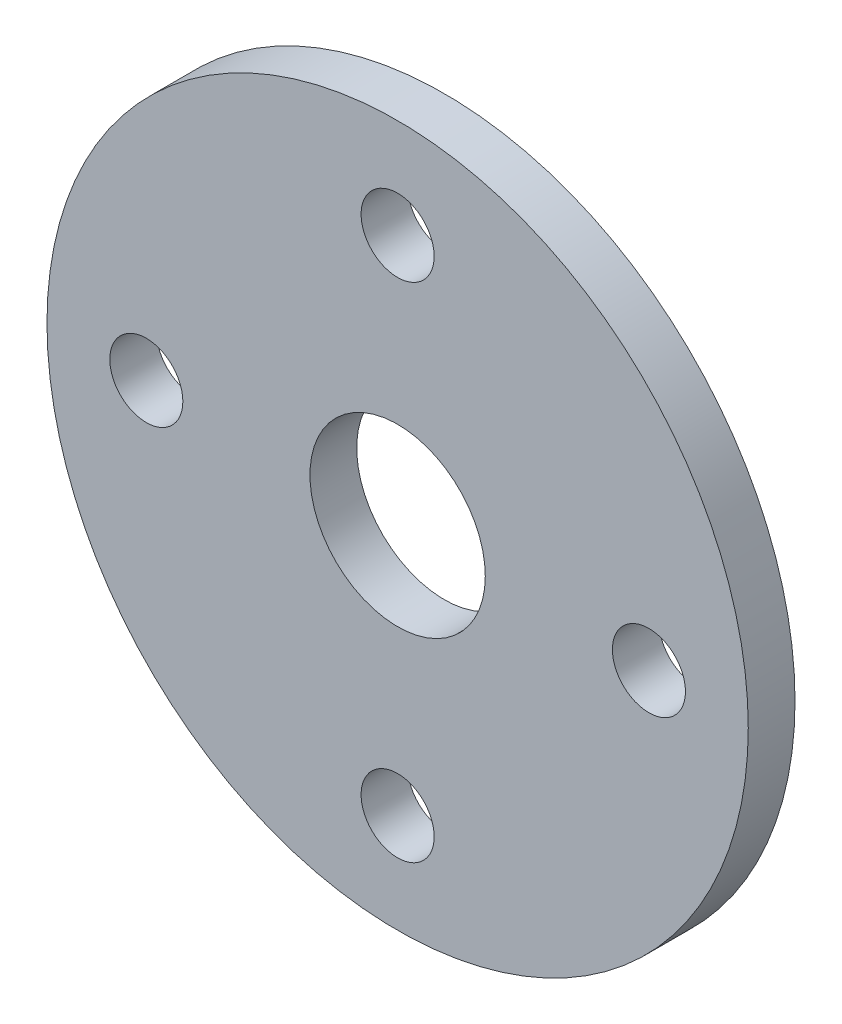
ISO-10303-21;
HEADER;
FILE_DESCRIPTION(('STEP AP214'),'2;1');
FILE_NAME('part.step','',(''),(''),'','','');
FILE_SCHEMA(('AUTOMOTIVE_DESIGN { 1 0 10303 214 1 1 1 1 }'));
ENDSEC;
DATA;
#1=APPLICATION_CONTEXT('core data for automotive mechanical design processes');
#2=APPLICATION_PROTOCOL_DEFINITION('international standard','automotive_design',2000,#1);
#3=PRODUCT_CONTEXT('',#1,'mechanical');
#4=PRODUCT('Part','Part','',(#3));
#5=PRODUCT_RELATED_PRODUCT_CATEGORY('part','',(#4));
#6=PRODUCT_DEFINITION_FORMATION('','',#4);
#7=PRODUCT_DEFINITION_CONTEXT('part definition',#1,'design');
#8=PRODUCT_DEFINITION('design','',#6,#7);
#9=PRODUCT_DEFINITION_SHAPE('','',#8);
#10=(LENGTH_UNIT() NAMED_UNIT(*) SI_UNIT(.MILLI.,.METRE.));
#11=(NAMED_UNIT(*) PLANE_ANGLE_UNIT() SI_UNIT($,.RADIAN.));
#12=(NAMED_UNIT(*) SI_UNIT($,.STERADIAN.) SOLID_ANGLE_UNIT());
#13=UNCERTAINTY_MEASURE_WITH_UNIT(LENGTH_MEASURE(1.E-05),#10,'distance_accuracy_value','');
#14=(GEOMETRIC_REPRESENTATION_CONTEXT(3) GLOBAL_UNCERTAINTY_ASSIGNED_CONTEXT((#13)) GLOBAL_UNIT_ASSIGNED_CONTEXT((#10,
#11,#12)) REPRESENTATION_CONTEXT('',''));
#15=CARTESIAN_POINT('',(0.,0.,0.));
#16=DIRECTION('',(0.,0.,1.));
#17=DIRECTION('',(1.,0.,0.));
#18=AXIS2_PLACEMENT_3D('',#15,#16,#17);
#19=CARTESIAN_POINT('',(2.22044604925031E-13,3.44169137633799E-12,3.99999999999712));
#20=DIRECTION('',(0.,0.,1.));
#21=DIRECTION('',(0.999999999999993,0.,0.));
#22=AXIS2_PLACEMENT_3D('',#19,#20,#21);
#23=PLANE('',#22);
#24=CARTESIAN_POINT('',(1.11022302462516E-13,-42.9999999999983,3.99999999999889));
#25=DIRECTION('',(0.,0.,1.));
#26=DIRECTION('',(0.999999999999993,0.,0.));
#27=AXIS2_PLACEMENT_3D('',#24,#25,#26);
#28=CIRCLE('',#27,6.25);
#29=CARTESIAN_POINT('',(6.25000000000007,-42.9999999999983,3.9999999999989));
#30=VERTEX_POINT('',#29);
#31=EDGE_CURVE('E196',#30,#30,#28,.T.);
#32=ORIENTED_EDGE('',*,*,#31,.F.);
#33=EDGE_LOOP('',(#32));
#34=FACE_BOUND('',#33,.T.);
#35=CARTESIAN_POINT('',(0.,43.0000000000001,4.00000000000023));
#36=DIRECTION('',(0.,0.,1.));
#37=DIRECTION('',(0.999999999999993,0.,0.));
#38=AXIS2_PLACEMENT_3D('',#35,#36,#37);
#39=CIRCLE('',#38,6.25);
#40=CARTESIAN_POINT('',(6.24999999999996,43.0000000000001,4.00000000000023));
#41=VERTEX_POINT('',#40);
#42=EDGE_CURVE('E214',#41,#41,#39,.T.);
#43=ORIENTED_EDGE('',*,*,#42,.F.);
#44=EDGE_LOOP('',(#43));
#45=FACE_BOUND('',#44,.T.);
#46=CARTESIAN_POINT('',(2.22044604925031E-13,3.44169137633799E-12,3.99999999999712));
#47=DIRECTION('',(0.,0.,1.));
#48=DIRECTION('',(0.999999999999993,0.,0.));
#49=AXIS2_PLACEMENT_3D('',#46,#47,#48);
#50=CIRCLE('',#49,60.);
#51=CARTESIAN_POINT('',(59.9999999999998,3.42337269643167E-12,3.99999999999718));
#52=VERTEX_POINT('',#51);
#53=EDGE_CURVE('E12',#52,#52,#50,.T.);
#54=ORIENTED_EDGE('',*,*,#53,.T.);
#55=EDGE_LOOP('',(#54));
#56=FACE_BOUND('',#55,.T.);
#57=CARTESIAN_POINT('',(2.22044604925031E-13,3.44169137633799E-12,3.99999999999712));
#58=DIRECTION('',(0.,0.,1.));
#59=DIRECTION('',(0.999999999999993,0.,0.));
#60=AXIS2_PLACEMENT_3D('',#57,#58,#59);
#61=CIRCLE('',#60,15.);
#62=CARTESIAN_POINT('',(15.0000000000001,3.43711170636141E-12,3.99999999999713));
#63=VERTEX_POINT('',#62);
#64=EDGE_CURVE('E64',#63,#63,#61,.T.);
#65=ORIENTED_EDGE('',*,*,#64,.F.);
#66=EDGE_LOOP('',(#65));
#67=FACE_BOUND('',#66,.T.);
#68=CARTESIAN_POINT('',(-42.9999999999998,2.55351295663786E-12,3.99999999999801));
#69=DIRECTION('',(0.,0.,1.));
#70=DIRECTION('',(0.999999999999993,0.,0.));
#71=AXIS2_PLACEMENT_3D('',#68,#69,#70);
#72=CIRCLE('',#71,6.25);
#73=CARTESIAN_POINT('',(-36.7499999999999,2.55160476081429E-12,3.99999999999801));
#74=VERTEX_POINT('',#73);
#75=EDGE_CURVE('E212',#74,#74,#72,.T.);
#76=ORIENTED_EDGE('',*,*,#75,.F.);
#77=EDGE_LOOP('',(#76));
#78=FACE_BOUND('',#77,.T.);
#79=CARTESIAN_POINT('',(42.9999999999996,1.55431223447522E-12,3.99999999999845));
#80=DIRECTION('',(0.,0.,1.));
#81=DIRECTION('',(0.999999999999993,0.,0.));
#82=AXIS2_PLACEMENT_3D('',#79,#80,#81);
#83=CIRCLE('',#82,6.25);
#84=CARTESIAN_POINT('',(49.2499999999996,1.55240403865164E-12,3.99999999999846));
#85=VERTEX_POINT('',#84);
#86=EDGE_CURVE('E95',#85,#85,#83,.T.);
#87=ORIENTED_EDGE('',*,*,#86,.F.);
#88=EDGE_LOOP('',(#87));
#89=FACE_BOUND('',#88,.T.);
#90=ADVANCED_FACE('F46',(#34,#45,#56,#67,#78,#89),#23,.T.);
#91=CARTESIAN_POINT('',(0.,1.88737914186277E-12,-4.00000000000245));
#92=DIRECTION('',(0.,0.,1.));
#93=DIRECTION('',(0.999999999999993,0.,0.));
#94=AXIS2_PLACEMENT_3D('',#91,#92,#93);
#95=PLANE('',#94);
#96=CARTESIAN_POINT('',(0.,1.88737914186277E-12,-4.00000000000245));
#97=DIRECTION('',(0.,0.,1.));
#98=DIRECTION('',(0.999999999999993,0.,0.));
#99=AXIS2_PLACEMENT_3D('',#96,#97,#98);
#100=CIRCLE('',#99,60.);
#101=CARTESIAN_POINT('',(59.9999999999996,1.86906046195645E-12,-4.00000000000239));
#102=VERTEX_POINT('',#101);
#103=EDGE_CURVE('E51',#102,#102,#100,.T.);
#104=ORIENTED_EDGE('',*,*,#103,.F.);
#105=EDGE_LOOP('',(#104));
#106=FACE_BOUND('',#105,.T.);
#107=CARTESIAN_POINT('',(0.,1.88737914186277E-12,-4.00000000000245));
#108=DIRECTION('',(0.,0.,1.));
#109=DIRECTION('',(0.999999999999993,0.,0.));
#110=AXIS2_PLACEMENT_3D('',#107,#108,#109);
#111=CIRCLE('',#110,15.);
#112=CARTESIAN_POINT('',(14.9999999999999,1.88279947188619E-12,-4.00000000000243));
#113=VERTEX_POINT('',#112);
#114=EDGE_CURVE('E67',#113,#113,#111,.T.);
#115=ORIENTED_EDGE('',*,*,#114,.T.);
#116=EDGE_LOOP('',(#115));
#117=FACE_BOUND('',#116,.T.);
#118=CARTESIAN_POINT('',(1.11022302462516E-13,43.0000000000016,-4.00000000000111));
#119=DIRECTION('',(0.,0.,1.));
#120=DIRECTION('',(0.999999999999993,0.,0.));
#121=AXIS2_PLACEMENT_3D('',#118,#119,#120);
#122=CIRCLE('',#121,6.25);
#123=CARTESIAN_POINT('',(6.25000000000007,43.0000000000016,-4.00000000000111));
#124=VERTEX_POINT('',#123);
#125=EDGE_CURVE('E85',#124,#124,#122,.T.);
#126=ORIENTED_EDGE('',*,*,#125,.T.);
#127=EDGE_LOOP('',(#126));
#128=FACE_BOUND('',#127,.T.);
#129=CARTESIAN_POINT('',(-42.9999999999996,3.21964677141295E-12,-4.00000000000333));
#130=DIRECTION('',(0.,0.,1.));
#131=DIRECTION('',(0.999999999999993,0.,0.));
#132=AXIS2_PLACEMENT_3D('',#129,#130,#131);
#133=CIRCLE('',#132,6.25);
#134=CARTESIAN_POINT('',(-36.7499999999996,3.21773857558938E-12,-4.00000000000333));
#135=VERTEX_POINT('',#134);
#136=EDGE_CURVE('E201',#135,#135,#133,.T.);
#137=ORIENTED_EDGE('',*,*,#136,.T.);
#138=EDGE_LOOP('',(#137));
#139=FACE_BOUND('',#138,.T.);
#140=CARTESIAN_POINT('',(1.11022302462516E-13,-42.9999999999985,-4.00000000000156));
#141=DIRECTION('',(0.,0.,1.));
#142=DIRECTION('',(0.999999999999993,0.,0.));
#143=AXIS2_PLACEMENT_3D('',#140,#141,#142);
#144=CIRCLE('',#143,6.25);
#145=CARTESIAN_POINT('',(6.25000000000007,-42.9999999999985,-4.00000000000155));
#146=VERTEX_POINT('',#145);
#147=EDGE_CURVE('E99',#146,#146,#144,.T.);
#148=ORIENTED_EDGE('',*,*,#147,.T.);
#149=EDGE_LOOP('',(#148));
#150=FACE_BOUND('',#149,.T.);
#151=CARTESIAN_POINT('',(42.9999999999994,1.88737914186277E-12,-4.00000000000067));
#152=DIRECTION('',(0.,0.,1.));
#153=DIRECTION('',(0.999999999999993,0.,0.));
#154=AXIS2_PLACEMENT_3D('',#151,#152,#153);
#155=CIRCLE('',#154,6.25);
#156=CARTESIAN_POINT('',(49.2499999999994,1.88547094603919E-12,-4.00000000000066));
#157=VERTEX_POINT('',#156);
#158=EDGE_CURVE('E100',#157,#157,#155,.T.);
#159=ORIENTED_EDGE('',*,*,#158,.T.);
#160=EDGE_LOOP('',(#159));
#161=FACE_BOUND('',#160,.T.);
#162=ADVANCED_FACE('F238',(#106,#117,#128,#139,#150,#161),#95,.F.);
#163=CARTESIAN_POINT('',(2.22044604925031E-13,3.44169137633799E-12,3.99999999999712));
#164=DIRECTION('',(0.,0.,-1.));
#165=DIRECTION('',(-0.999999999999993,0.,0.));
#166=AXIS2_PLACEMENT_3D('',#163,#164,#165);
#167=CYLINDRICAL_SURFACE('',#166,60.);
#168=ORIENTED_EDGE('',*,*,#53,.F.);
#169=EDGE_LOOP('',(#168));
#170=FACE_BOUND('',#169,.T.);
#171=ORIENTED_EDGE('',*,*,#103,.T.);
#172=EDGE_LOOP('',(#171));
#173=FACE_BOUND('',#172,.T.);
#174=ADVANCED_FACE('F49',(#170,#173),#167,.T.);
#175=CARTESIAN_POINT('',(2.22044604925031E-13,3.44169137633799E-12,3.99999999999712));
#176=DIRECTION('',(0.,0.,-1.));
#177=DIRECTION('',(-0.999999999999993,0.,0.));
#178=AXIS2_PLACEMENT_3D('',#175,#176,#177);
#179=CYLINDRICAL_SURFACE('',#178,15.);
#180=ORIENTED_EDGE('',*,*,#64,.T.);
#181=EDGE_LOOP('',(#180));
#182=FACE_BOUND('',#181,.T.);
#183=ORIENTED_EDGE('',*,*,#114,.F.);
#184=EDGE_LOOP('',(#183));
#185=FACE_BOUND('',#184,.T.);
#186=ADVANCED_FACE('F255',(#182,#185),#179,.F.);
#187=CARTESIAN_POINT('',(0.,43.0000000000001,4.00000000000023));
#188=DIRECTION('',(0.,0.,-1.));
#189=DIRECTION('',(-0.999999999999993,0.,0.));
#190=AXIS2_PLACEMENT_3D('',#187,#188,#189);
#191=CYLINDRICAL_SURFACE('',#190,6.25);
#192=ORIENTED_EDGE('',*,*,#42,.T.);
#193=EDGE_LOOP('',(#192));
#194=FACE_BOUND('',#193,.T.);
#195=ORIENTED_EDGE('',*,*,#125,.F.);
#196=EDGE_LOOP('',(#195));
#197=FACE_BOUND('',#196,.T.);
#198=ADVANCED_FACE('F267',(#194,#197),#191,.F.);
#199=CARTESIAN_POINT('',(-42.9999999999998,2.55351295663786E-12,3.99999999999801));
#200=DIRECTION('',(0.,0.,-1.));
#201=DIRECTION('',(-0.999999999999993,0.,0.));
#202=AXIS2_PLACEMENT_3D('',#199,#200,#201);
#203=CYLINDRICAL_SURFACE('',#202,6.25);
#204=ORIENTED_EDGE('',*,*,#75,.T.);
#205=EDGE_LOOP('',(#204));
#206=FACE_BOUND('',#205,.T.);
#207=ORIENTED_EDGE('',*,*,#136,.F.);
#208=EDGE_LOOP('',(#207));
#209=FACE_BOUND('',#208,.T.);
#210=ADVANCED_FACE('F233',(#206,#209),#203,.F.);
#211=CARTESIAN_POINT('',(1.11022302462516E-13,-42.9999999999983,3.99999999999889));
#212=DIRECTION('',(0.,0.,-1.));
#213=DIRECTION('',(-0.999999999999993,0.,0.));
#214=AXIS2_PLACEMENT_3D('',#211,#212,#213);
#215=CYLINDRICAL_SURFACE('',#214,6.25);
#216=ORIENTED_EDGE('',*,*,#31,.T.);
#217=EDGE_LOOP('',(#216));
#218=FACE_BOUND('',#217,.T.);
#219=ORIENTED_EDGE('',*,*,#147,.F.);
#220=EDGE_LOOP('',(#219));
#221=FACE_BOUND('',#220,.T.);
#222=ADVANCED_FACE('F246',(#218,#221),#215,.F.);
#223=CARTESIAN_POINT('',(42.9999999999996,1.55431223447522E-12,3.99999999999845));
#224=DIRECTION('',(0.,0.,-1.));
#225=DIRECTION('',(-0.999999999999993,0.,0.));
#226=AXIS2_PLACEMENT_3D('',#223,#224,#225);
#227=CYLINDRICAL_SURFACE('',#226,6.25);
#228=ORIENTED_EDGE('',*,*,#86,.T.);
#229=EDGE_LOOP('',(#228));
#230=FACE_BOUND('',#229,.T.);
#231=ORIENTED_EDGE('',*,*,#158,.F.);
#232=EDGE_LOOP('',(#231));
#233=FACE_BOUND('',#232,.T.);
#234=ADVANCED_FACE('F243',(#230,#233),#227,.F.);
#235=CLOSED_SHELL('',(#90,#162,#174,#186,#198,#210,#222,#234));
#236=MANIFOLD_SOLID_BREP('B2',#235);
#237=ADVANCED_BREP_SHAPE_REPRESENTATION('',(#18,#236),#14);
#238=SHAPE_DEFINITION_REPRESENTATION(#9,#237);
ENDSEC;
END-ISO-10303-21;
